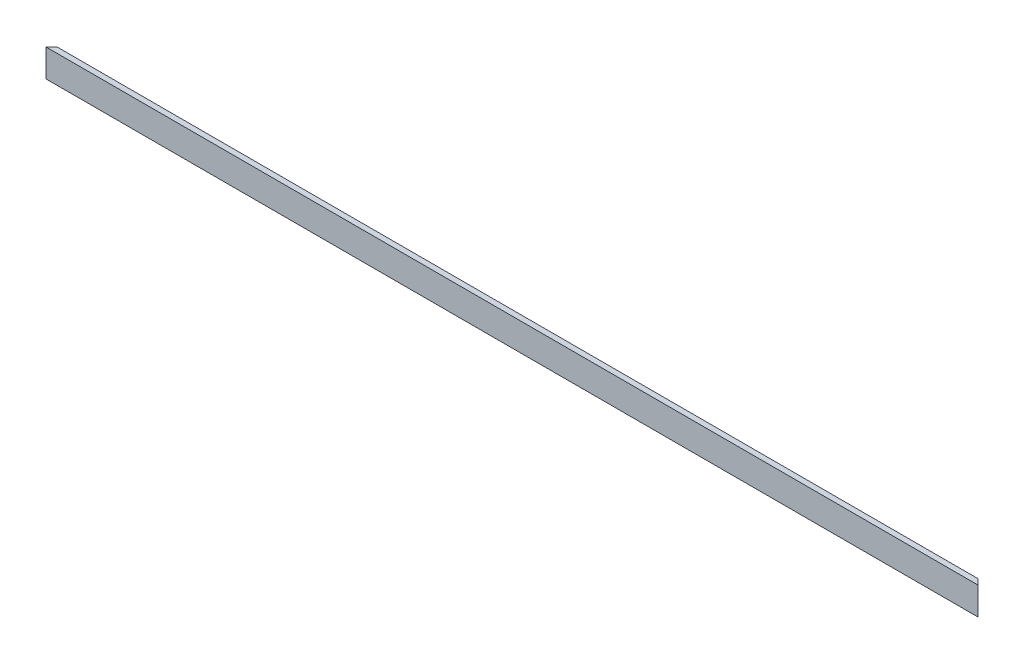
ISO-10303-21;
HEADER;
FILE_DESCRIPTION(('STEP AP214'),'2;1');
FILE_NAME('part.step','',(''),(''),'','','');
FILE_SCHEMA(('AUTOMOTIVE_DESIGN { 1 0 10303 214 1 1 1 1 }'));
ENDSEC;
DATA;
#1=APPLICATION_CONTEXT('core data for automotive mechanical design processes');
#2=APPLICATION_PROTOCOL_DEFINITION('international standard','automotive_design',2000,#1);
#3=PRODUCT_CONTEXT('',#1,'mechanical');
#4=PRODUCT('Part','Part','',(#3));
#5=PRODUCT_RELATED_PRODUCT_CATEGORY('part','',(#4));
#6=PRODUCT_DEFINITION_FORMATION('','',#4);
#7=PRODUCT_DEFINITION_CONTEXT('part definition',#1,'design');
#8=PRODUCT_DEFINITION('design','',#6,#7);
#9=PRODUCT_DEFINITION_SHAPE('','',#8);
#10=(LENGTH_UNIT() NAMED_UNIT(*) SI_UNIT(.MILLI.,.METRE.));
#11=(NAMED_UNIT(*) PLANE_ANGLE_UNIT() SI_UNIT($,.RADIAN.));
#12=(NAMED_UNIT(*) SI_UNIT($,.STERADIAN.) SOLID_ANGLE_UNIT());
#13=UNCERTAINTY_MEASURE_WITH_UNIT(LENGTH_MEASURE(1.E-05),#10,'distance_accuracy_value','');
#14=(GEOMETRIC_REPRESENTATION_CONTEXT(3) GLOBAL_UNCERTAINTY_ASSIGNED_CONTEXT((#13)) GLOBAL_UNIT_ASSIGNED_CONTEXT((#10,
#11,#12)) REPRESENTATION_CONTEXT('',''));
#15=CARTESIAN_POINT('',(0.,0.,0.));
#16=DIRECTION('',(0.,0.,1.));
#17=DIRECTION('',(1.,0.,0.));
#18=AXIS2_PLACEMENT_3D('',#15,#16,#17);
#19=CARTESIAN_POINT('',(0.,0.,38.1));
#20=DIRECTION('',(0.,1.,0.));
#21=DIRECTION('',(0.,0.,1.));
#22=AXIS2_PLACEMENT_3D('',#19,#20,#21);
#23=PLANE('',#22);
#24=DIRECTION('',(1.,0.,0.));
#25=VECTOR('',#24,1.);
#26=CARTESIAN_POINT('',(0.,0.,0.));
#27=LINE('',#26,#25);
#28=CARTESIAN_POINT('',(38.1000000000001,0.,-1.76291273246143E-13));
#29=VERTEX_POINT('',#28);
#30=CARTESIAN_POINT('',(6368.86307345283,0.,0.));
#31=VERTEX_POINT('',#30);
#32=EDGE_CURVE('E88',#29,#31,#27,.T.);
#33=ORIENTED_EDGE('',*,*,#32,.T.);
#34=DIRECTION('',(-0.707106781186556,0.,-0.707106781186539));
#35=VECTOR('',#34,1.);
#36=CARTESIAN_POINT('',(6406.96307345283,0.,38.1));
#37=LINE('',#36,#35);
#38=CARTESIAN_POINT('',(6406.96307345283,0.,38.0999999999997));
#39=VERTEX_POINT('',#38);
#40=EDGE_CURVE('E49',#39,#31,#37,.T.);
#41=ORIENTED_EDGE('',*,*,#40,.F.);
#42=DIRECTION('',(1.,0.,0.));
#43=VECTOR('',#42,1.);
#44=CARTESIAN_POINT('',(0.,0.,38.1));
#45=LINE('',#44,#43);
#46=CARTESIAN_POINT('',(0.,0.,38.1));
#47=VERTEX_POINT('',#46);
#48=EDGE_CURVE('E90',#47,#39,#45,.T.);
#49=ORIENTED_EDGE('',*,*,#48,.F.);
#50=DIRECTION('',(-0.707106781186547,0.,0.707106781186548));
#51=VECTOR('',#50,1.);
#52=CARTESIAN_POINT('',(0.,0.,38.1));
#53=LINE('',#52,#51);
#54=EDGE_CURVE('E92',#29,#47,#53,.T.);
#55=ORIENTED_EDGE('',*,*,#54,.F.);
#56=EDGE_LOOP('',(#33,#41,#49,#55));
#57=FACE_BOUND('',#56,.T.);
#58=ADVANCED_FACE('F33',(#57),#23,.F.);
#59=CARTESIAN_POINT('',(0.,190.5,38.1));
#60=DIRECTION('',(0.,-1.,0.));
#61=DIRECTION('',(0.,0.,-1.));
#62=AXIS2_PLACEMENT_3D('',#59,#60,#61);
#63=PLANE('',#62);
#64=DIRECTION('',(-1.,0.,0.));
#65=VECTOR('',#64,1.);
#66=CARTESIAN_POINT('',(0.,190.5,38.1));
#67=LINE('',#66,#65);
#68=CARTESIAN_POINT('',(6406.96307345283,190.5,38.1));
#69=VERTEX_POINT('',#68);
#70=CARTESIAN_POINT('',(0.,190.5,38.1));
#71=VERTEX_POINT('',#70);
#72=EDGE_CURVE('E11',#69,#71,#67,.T.);
#73=ORIENTED_EDGE('',*,*,#72,.F.);
#74=DIRECTION('',(0.707106781186556,0.,0.707106781186539));
#75=VECTOR('',#74,1.);
#76=CARTESIAN_POINT('',(6406.96307345283,190.5,38.1));
#77=LINE('',#76,#75);
#78=CARTESIAN_POINT('',(6368.86307345283,190.5,0.));
#79=VERTEX_POINT('',#78);
#80=EDGE_CURVE('E75',#79,#69,#77,.T.);
#81=ORIENTED_EDGE('',*,*,#80,.F.);
#82=DIRECTION('',(-1.,0.,0.));
#83=VECTOR('',#82,1.);
#84=CARTESIAN_POINT('',(0.,190.5,0.));
#85=LINE('',#84,#83);
#86=CARTESIAN_POINT('',(38.1000000000001,190.5,0.));
#87=VERTEX_POINT('',#86);
#88=EDGE_CURVE('E36',#79,#87,#85,.T.);
#89=ORIENTED_EDGE('',*,*,#88,.T.);
#90=DIRECTION('',(0.707106781186547,0.,-0.707106781186548));
#91=VECTOR('',#90,1.);
#92=CARTESIAN_POINT('',(0.,190.5,38.1));
#93=LINE('',#92,#91);
#94=EDGE_CURVE('E101',#71,#87,#93,.T.);
#95=ORIENTED_EDGE('',*,*,#94,.F.);
#96=EDGE_LOOP('',(#73,#81,#89,#95));
#97=FACE_BOUND('',#96,.T.);
#98=ADVANCED_FACE('F82',(#97),#63,.F.);
#99=CARTESIAN_POINT('',(0.,0.,38.1));
#100=DIRECTION('',(0.,0.,-1.));
#101=DIRECTION('',(-1.,0.,0.));
#102=AXIS2_PLACEMENT_3D('',#99,#100,#101);
#103=PLANE('',#102);
#104=DIRECTION('',(0.,-1.,0.));
#105=VECTOR('',#104,1.);
#106=CARTESIAN_POINT('',(0.,0.,38.1));
#107=LINE('',#106,#105);
#108=EDGE_CURVE('E87',#71,#47,#107,.T.);
#109=ORIENTED_EDGE('',*,*,#108,.T.);
#110=ORIENTED_EDGE('',*,*,#48,.T.);
#111=DIRECTION('',(0.,1.,0.));
#112=VECTOR('',#111,1.);
#113=CARTESIAN_POINT('',(6406.96307345283,0.,38.1));
#114=LINE('',#113,#112);
#115=EDGE_CURVE('E41',#39,#69,#114,.T.);
#116=ORIENTED_EDGE('',*,*,#115,.T.);
#117=ORIENTED_EDGE('',*,*,#72,.T.);
#118=EDGE_LOOP('',(#109,#110,#116,#117));
#119=FACE_BOUND('',#118,.T.);
#120=ADVANCED_FACE('F106',(#119),#103,.F.);
#121=CARTESIAN_POINT('',(0.,0.,0.));
#122=DIRECTION('',(0.,0.,-1.));
#123=DIRECTION('',(-1.,0.,0.));
#124=AXIS2_PLACEMENT_3D('',#121,#122,#123);
#125=PLANE('',#124);
#126=DIRECTION('',(0.,1.,0.));
#127=VECTOR('',#126,1.);
#128=CARTESIAN_POINT('',(6368.86307345283,-53.8815367264155,0.));
#129=LINE('',#128,#127);
#130=EDGE_CURVE('E73',#31,#79,#129,.T.);
#131=ORIENTED_EDGE('',*,*,#130,.F.);
#132=ORIENTED_EDGE('',*,*,#32,.F.);
#133=DIRECTION('',(0.,1.,0.));
#134=VECTOR('',#133,1.);
#135=CARTESIAN_POINT('',(38.1000000000001,-53.8815367264155,-1.76291273246143E-13));
#136=LINE('',#135,#134);
#137=EDGE_CURVE('E86',#29,#87,#136,.T.);
#138=ORIENTED_EDGE('',*,*,#137,.T.);
#139=ORIENTED_EDGE('',*,*,#88,.F.);
#140=EDGE_LOOP('',(#131,#132,#138,#139));
#141=FACE_BOUND('',#140,.T.);
#142=ADVANCED_FACE('F85',(#141),#125,.T.);
#143=CARTESIAN_POINT('',(0.,-53.8815367264155,38.1));
#144=DIRECTION('',(0.707106781186548,0.,0.707106781186547));
#145=DIRECTION('',(0.707106781186547,0.,-0.707106781186548));
#146=AXIS2_PLACEMENT_3D('',#143,#144,#145);
#147=PLANE('',#146);
#148=ORIENTED_EDGE('',*,*,#54,.T.);
#149=ORIENTED_EDGE('',*,*,#108,.F.);
#150=ORIENTED_EDGE('',*,*,#94,.T.);
#151=ORIENTED_EDGE('',*,*,#137,.F.);
#152=EDGE_LOOP('',(#148,#149,#150,#151));
#153=FACE_BOUND('',#152,.T.);
#154=ADVANCED_FACE('F104',(#153),#147,.F.);
#155=CARTESIAN_POINT('',(6406.96307345283,-53.8815367264155,38.1));
#156=DIRECTION('',(-0.707106781186539,0.,0.707106781186556));
#157=DIRECTION('',(0.707106781186556,0.,0.707106781186539));
#158=AXIS2_PLACEMENT_3D('',#155,#156,#157);
#159=PLANE('',#158);
#160=ORIENTED_EDGE('',*,*,#40,.T.);
#161=ORIENTED_EDGE('',*,*,#130,.T.);
#162=ORIENTED_EDGE('',*,*,#80,.T.);
#163=ORIENTED_EDGE('',*,*,#115,.F.);
#164=EDGE_LOOP('',(#160,#161,#162,#163));
#165=FACE_BOUND('',#164,.T.);
#166=ADVANCED_FACE('F74',(#165),#159,.F.);
#167=CLOSED_SHELL('',(#58,#98,#120,#142,#154,#166));
#168=MANIFOLD_SOLID_BREP('B2',#167);
#169=ADVANCED_BREP_SHAPE_REPRESENTATION('',(#18,#168),#14);
#170=SHAPE_DEFINITION_REPRESENTATION(#9,#169);
ENDSEC;
END-ISO-10303-21;
